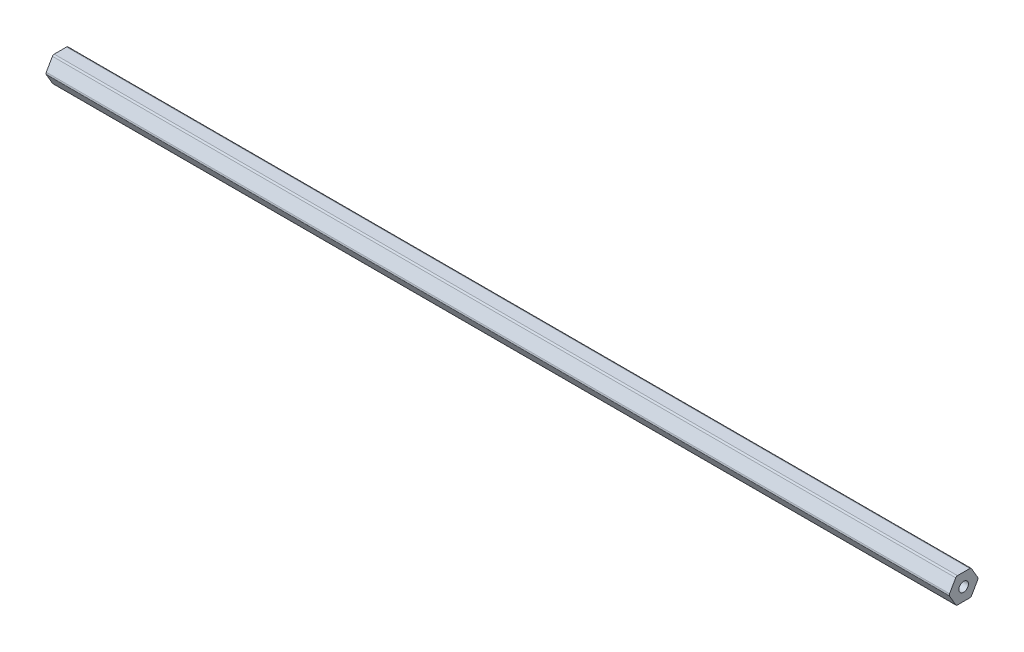
ISO-10303-21;
HEADER;
FILE_DESCRIPTION(('STEP AP214'),'2;1');
FILE_NAME('part.step','',(''),(''),'','','');
FILE_SCHEMA(('AUTOMOTIVE_DESIGN { 1 0 10303 214 1 1 1 1 }'));
ENDSEC;
DATA;
#1=APPLICATION_CONTEXT('core data for automotive mechanical design processes');
#2=APPLICATION_PROTOCOL_DEFINITION('international standard','automotive_design',2000,#1);
#3=PRODUCT_CONTEXT('',#1,'mechanical');
#4=PRODUCT('Part','Part','',(#3));
#5=PRODUCT_RELATED_PRODUCT_CATEGORY('part','',(#4));
#6=PRODUCT_DEFINITION_FORMATION('','',#4);
#7=PRODUCT_DEFINITION_CONTEXT('part definition',#1,'design');
#8=PRODUCT_DEFINITION('design','',#6,#7);
#9=PRODUCT_DEFINITION_SHAPE('','',#8);
#10=(LENGTH_UNIT() NAMED_UNIT(*) SI_UNIT(.MILLI.,.METRE.));
#11=(NAMED_UNIT(*) PLANE_ANGLE_UNIT() SI_UNIT($,.RADIAN.));
#12=(NAMED_UNIT(*) SI_UNIT($,.STERADIAN.) SOLID_ANGLE_UNIT());
#13=UNCERTAINTY_MEASURE_WITH_UNIT(LENGTH_MEASURE(1.E-05),#10,'distance_accuracy_value','');
#14=(GEOMETRIC_REPRESENTATION_CONTEXT(3) GLOBAL_UNCERTAINTY_ASSIGNED_CONTEXT((#13)) GLOBAL_UNIT_ASSIGNED_CONTEXT((#10,
#11,#12)) REPRESENTATION_CONTEXT('',''));
#15=CARTESIAN_POINT('',(0.,0.,0.));
#16=DIRECTION('',(0.,0.,1.));
#17=DIRECTION('',(1.,0.,0.));
#18=AXIS2_PLACEMENT_3D('',#15,#16,#17);
#19=CARTESIAN_POINT('',(-225.425,5.334,-3.07958633585748));
#20=DIRECTION('',(1.,0.,0.));
#21=DIRECTION('',(0.,0.,-1.));
#22=AXIS2_PLACEMENT_3D('',#19,#20,#21);
#23=CYLINDRICAL_SURFACE('',#22,1.016);
#24=DIRECTION('',(1.,0.,0.));
#25=VECTOR('',#24,1.);
#26=CARTESIAN_POINT('',(-225.425,6.34999999999999,-3.07958633585748));
#27=LINE('',#26,#25);
#28=CARTESIAN_POINT('',(-225.425,6.34999999999999,-3.07958633585748));
#29=VERTEX_POINT('',#28);
#30=CARTESIAN_POINT('',(225.425,6.34999999999999,-3.07958633585748));
#31=VERTEX_POINT('',#30);
#32=EDGE_CURVE('E43',#29,#31,#27,.T.);
#33=ORIENTED_EDGE('',*,*,#32,.T.);
#34=CARTESIAN_POINT('',(225.425,5.334,-3.07958633585748));
#35=DIRECTION('',(1.,0.,0.));
#36=DIRECTION('',(0.,0.,1.));
#37=AXIS2_PLACEMENT_3D('',#34,#35,#36);
#38=CIRCLE('',#37,1.016);
#39=CARTESIAN_POINT('',(225.425,5.84199999999999,-3.95946814610247));
#40=VERTEX_POINT('',#39);
#41=EDGE_CURVE('E128',#40,#31,#38,.T.);
#42=ORIENTED_EDGE('',*,*,#41,.F.);
#43=DIRECTION('',(1.,0.,0.));
#44=VECTOR('',#43,1.);
#45=CARTESIAN_POINT('',(-225.425,5.84199999999999,-3.95946814610247));
#46=LINE('',#45,#44);
#47=CARTESIAN_POINT('',(-225.425,5.84199999999999,-3.95946814610247));
#48=VERTEX_POINT('',#47);
#49=EDGE_CURVE('E11',#48,#40,#46,.T.);
#50=ORIENTED_EDGE('',*,*,#49,.F.);
#51=CARTESIAN_POINT('',(-225.425,5.334,-3.07958633585748));
#52=DIRECTION('',(1.,0.,0.));
#53=DIRECTION('',(0.,0.,1.));
#54=AXIS2_PLACEMENT_3D('',#51,#52,#53);
#55=CIRCLE('',#54,1.016);
#56=EDGE_CURVE('E129',#48,#29,#55,.T.);
#57=ORIENTED_EDGE('',*,*,#56,.T.);
#58=EDGE_LOOP('',(#33,#42,#50,#57));
#59=FACE_BOUND('',#58,.T.);
#60=ADVANCED_FACE('F40',(#59),#23,.T.);
#61=CARTESIAN_POINT('',(-225.425,0.50799999999998,-7.03905448195992));
#62=DIRECTION('',(0.,0.499999999999997,-0.86602540378444));
#63=DIRECTION('',(0.,0.86602540378444,0.499999999999997));
#64=AXIS2_PLACEMENT_3D('',#61,#62,#63);
#65=PLANE('',#64);
#66=ORIENTED_EDGE('',*,*,#49,.T.);
#67=DIRECTION('',(0.,0.86602540378444,0.499999999999997));
#68=VECTOR('',#67,1.);
#69=CARTESIAN_POINT('',(225.425,0.50799999999998,-7.03905448195992));
#70=LINE('',#69,#68);
#71=CARTESIAN_POINT('',(225.425,0.507999999999981,-7.03905448195992));
#72=VERTEX_POINT('',#71);
#73=EDGE_CURVE('E147',#72,#40,#70,.T.);
#74=ORIENTED_EDGE('',*,*,#73,.F.);
#75=DIRECTION('',(1.,0.,0.));
#76=VECTOR('',#75,1.);
#77=CARTESIAN_POINT('',(-225.425,0.507999999999981,-7.03905448195992));
#78=LINE('',#77,#76);
#79=CARTESIAN_POINT('',(-225.425,0.507999999999981,-7.03905448195992));
#80=VERTEX_POINT('',#79);
#81=EDGE_CURVE('E48',#80,#72,#78,.T.);
#82=ORIENTED_EDGE('',*,*,#81,.F.);
#83=DIRECTION('',(0.,0.86602540378444,0.499999999999997));
#84=VECTOR('',#83,1.);
#85=CARTESIAN_POINT('',(-225.425,0.50799999999998,-7.03905448195992));
#86=LINE('',#85,#84);
#87=EDGE_CURVE('E134',#80,#48,#86,.T.);
#88=ORIENTED_EDGE('',*,*,#87,.T.);
#89=EDGE_LOOP('',(#66,#74,#82,#88));
#90=FACE_BOUND('',#89,.T.);
#91=ADVANCED_FACE('F265',(#90),#65,.T.);
#92=CARTESIAN_POINT('',(-225.425,0.,-6.15917267171493));
#93=DIRECTION('',(1.,0.,0.));
#94=DIRECTION('',(0.,0.,-1.));
#95=AXIS2_PLACEMENT_3D('',#92,#93,#94);
#96=CYLINDRICAL_SURFACE('',#95,1.016);
#97=ORIENTED_EDGE('',*,*,#81,.T.);
#98=CARTESIAN_POINT('',(225.425,0.,-6.15917267171493));
#99=DIRECTION('',(1.,0.,0.));
#100=DIRECTION('',(0.,0.,1.));
#101=AXIS2_PLACEMENT_3D('',#98,#99,#100);
#102=CIRCLE('',#101,1.016);
#103=CARTESIAN_POINT('',(225.425,-0.508000000000019,-7.03905448195992));
#104=VERTEX_POINT('',#103);
#105=EDGE_CURVE('E175',#104,#72,#102,.T.);
#106=ORIENTED_EDGE('',*,*,#105,.F.);
#107=DIRECTION('',(1.,0.,0.));
#108=VECTOR('',#107,1.);
#109=CARTESIAN_POINT('',(-225.425,-0.508000000000019,-7.03905448195992));
#110=LINE('',#109,#108);
#111=CARTESIAN_POINT('',(-225.425,-0.508000000000019,-7.03905448195992));
#112=VERTEX_POINT('',#111);
#113=EDGE_CURVE('E212',#112,#104,#110,.T.);
#114=ORIENTED_EDGE('',*,*,#113,.F.);
#115=CARTESIAN_POINT('',(-225.425,0.,-6.15917267171493));
#116=DIRECTION('',(1.,0.,0.));
#117=DIRECTION('',(0.,0.,1.));
#118=AXIS2_PLACEMENT_3D('',#115,#116,#117);
#119=CIRCLE('',#118,1.016);
#120=EDGE_CURVE('E208',#112,#80,#119,.T.);
#121=ORIENTED_EDGE('',*,*,#120,.T.);
#122=EDGE_LOOP('',(#97,#106,#114,#121));
#123=FACE_BOUND('',#122,.T.);
#124=ADVANCED_FACE('F263',(#123),#96,.T.);
#125=CARTESIAN_POINT('',(-225.425,-5.84200000000001,-3.95946814610244));
#126=DIRECTION('',(0.,-0.500000000000002,-0.866025403784437));
#127=DIRECTION('',(0.,0.866025403784437,-0.500000000000003));
#128=AXIS2_PLACEMENT_3D('',#125,#126,#127);
#129=PLANE('',#128);
#130=ORIENTED_EDGE('',*,*,#113,.T.);
#131=DIRECTION('',(0.,0.866025403784437,-0.500000000000002));
#132=VECTOR('',#131,1.);
#133=CARTESIAN_POINT('',(225.425,-5.84200000000001,-3.95946814610244));
#134=LINE('',#133,#132);
#135=CARTESIAN_POINT('',(225.425,-5.84200000000001,-3.95946814610244));
#136=VERTEX_POINT('',#135);
#137=EDGE_CURVE('E172',#136,#104,#134,.T.);
#138=ORIENTED_EDGE('',*,*,#137,.F.);
#139=DIRECTION('',(1.,0.,0.));
#140=VECTOR('',#139,1.);
#141=CARTESIAN_POINT('',(-225.425,-5.84200000000001,-3.95946814610244));
#142=LINE('',#141,#140);
#143=CARTESIAN_POINT('',(-225.425,-5.84200000000001,-3.95946814610244));
#144=VERTEX_POINT('',#143);
#145=EDGE_CURVE('E214',#144,#136,#142,.T.);
#146=ORIENTED_EDGE('',*,*,#145,.F.);
#147=DIRECTION('',(0.,0.866025403784437,-0.500000000000002));
#148=VECTOR('',#147,1.);
#149=CARTESIAN_POINT('',(-225.425,-5.84200000000001,-3.95946814610244));
#150=LINE('',#149,#148);
#151=EDGE_CURVE('E205',#144,#112,#150,.T.);
#152=ORIENTED_EDGE('',*,*,#151,.T.);
#153=EDGE_LOOP('',(#130,#138,#146,#152));
#154=FACE_BOUND('',#153,.T.);
#155=ADVANCED_FACE('F261',(#154),#129,.T.);
#156=CARTESIAN_POINT('',(-225.425,-5.33400000000001,-3.07958633585745));
#157=DIRECTION('',(1.,0.,0.));
#158=DIRECTION('',(0.,0.,-1.));
#159=AXIS2_PLACEMENT_3D('',#156,#157,#158);
#160=CYLINDRICAL_SURFACE('',#159,1.016);
#161=ORIENTED_EDGE('',*,*,#145,.T.);
#162=CARTESIAN_POINT('',(225.425,-5.33400000000001,-3.07958633585745));
#163=DIRECTION('',(1.,0.,0.));
#164=DIRECTION('',(0.,0.,1.));
#165=AXIS2_PLACEMENT_3D('',#162,#163,#164);
#166=CIRCLE('',#165,1.016);
#167=CARTESIAN_POINT('',(225.425,-6.35000000000001,-3.07958633585745));
#168=VERTEX_POINT('',#167);
#169=EDGE_CURVE('E169',#168,#136,#166,.T.);
#170=ORIENTED_EDGE('',*,*,#169,.F.);
#171=DIRECTION('',(1.,0.,0.));
#172=VECTOR('',#171,1.);
#173=CARTESIAN_POINT('',(-225.425,-6.35000000000001,-3.07958633585745));
#174=LINE('',#173,#172);
#175=CARTESIAN_POINT('',(-225.425,-6.35000000000001,-3.07958633585745));
#176=VERTEX_POINT('',#175);
#177=EDGE_CURVE('E216',#176,#168,#174,.T.);
#178=ORIENTED_EDGE('',*,*,#177,.F.);
#179=CARTESIAN_POINT('',(-225.425,-5.33400000000001,-3.07958633585745));
#180=DIRECTION('',(1.,0.,0.));
#181=DIRECTION('',(0.,0.,1.));
#182=AXIS2_PLACEMENT_3D('',#179,#180,#181);
#183=CIRCLE('',#182,1.016);
#184=EDGE_CURVE('E202',#176,#144,#183,.T.);
#185=ORIENTED_EDGE('',*,*,#184,.T.);
#186=EDGE_LOOP('',(#161,#170,#178,#185));
#187=FACE_BOUND('',#186,.T.);
#188=ADVANCED_FACE('F256',(#187),#160,.T.);
#189=CARTESIAN_POINT('',(-225.425,-6.35,3.07958633585748));
#190=DIRECTION('',(0.,-1.,0.));
#191=DIRECTION('',(0.,0.,-1.));
#192=AXIS2_PLACEMENT_3D('',#189,#190,#191);
#193=PLANE('',#192);
#194=ORIENTED_EDGE('',*,*,#177,.T.);
#195=DIRECTION('',(0.,0.,-1.));
#196=VECTOR('',#195,1.);
#197=CARTESIAN_POINT('',(225.425,-6.35,3.07958633585748));
#198=LINE('',#197,#196);
#199=CARTESIAN_POINT('',(225.425,-6.35,3.07958633585748));
#200=VERTEX_POINT('',#199);
#201=EDGE_CURVE('E166',#200,#168,#198,.T.);
#202=ORIENTED_EDGE('',*,*,#201,.F.);
#203=DIRECTION('',(1.,0.,0.));
#204=VECTOR('',#203,1.);
#205=CARTESIAN_POINT('',(-225.425,-6.35,3.07958633585748));
#206=LINE('',#205,#204);
#207=CARTESIAN_POINT('',(-225.425,-6.35,3.07958633585748));
#208=VERTEX_POINT('',#207);
#209=EDGE_CURVE('E218',#208,#200,#206,.T.);
#210=ORIENTED_EDGE('',*,*,#209,.F.);
#211=DIRECTION('',(0.,0.,-1.));
#212=VECTOR('',#211,1.);
#213=CARTESIAN_POINT('',(-225.425,-6.35,3.07958633585748));
#214=LINE('',#213,#212);
#215=EDGE_CURVE('E199',#208,#176,#214,.T.);
#216=ORIENTED_EDGE('',*,*,#215,.T.);
#217=EDGE_LOOP('',(#194,#202,#210,#216));
#218=FACE_BOUND('',#217,.T.);
#219=ADVANCED_FACE('F251',(#218),#193,.T.);
#220=CARTESIAN_POINT('',(-225.425,-5.334,3.07958633585748));
#221=DIRECTION('',(1.,0.,0.));
#222=DIRECTION('',(0.,0.,-1.));
#223=AXIS2_PLACEMENT_3D('',#220,#221,#222);
#224=CYLINDRICAL_SURFACE('',#223,1.016);
#225=ORIENTED_EDGE('',*,*,#209,.T.);
#226=CARTESIAN_POINT('',(225.425,-5.334,3.07958633585748));
#227=DIRECTION('',(1.,0.,0.));
#228=DIRECTION('',(0.,0.,1.));
#229=AXIS2_PLACEMENT_3D('',#226,#227,#228);
#230=CIRCLE('',#229,1.016);
#231=CARTESIAN_POINT('',(225.425,-5.84199999999999,3.95946814610247));
#232=VERTEX_POINT('',#231);
#233=EDGE_CURVE('E163',#232,#200,#230,.T.);
#234=ORIENTED_EDGE('',*,*,#233,.F.);
#235=DIRECTION('',(1.,0.,0.));
#236=VECTOR('',#235,1.);
#237=CARTESIAN_POINT('',(-225.425,-5.84199999999999,3.95946814610247));
#238=LINE('',#237,#236);
#239=CARTESIAN_POINT('',(-225.425,-5.84199999999999,3.95946814610247));
#240=VERTEX_POINT('',#239);
#241=EDGE_CURVE('E220',#240,#232,#238,.T.);
#242=ORIENTED_EDGE('',*,*,#241,.F.);
#243=CARTESIAN_POINT('',(-225.425,-5.334,3.07958633585748));
#244=DIRECTION('',(1.,0.,0.));
#245=DIRECTION('',(0.,0.,1.));
#246=AXIS2_PLACEMENT_3D('',#243,#244,#245);
#247=CIRCLE('',#246,1.016);
#248=EDGE_CURVE('E196',#240,#208,#247,.T.);
#249=ORIENTED_EDGE('',*,*,#248,.T.);
#250=EDGE_LOOP('',(#225,#234,#242,#249));
#251=FACE_BOUND('',#250,.T.);
#252=ADVANCED_FACE('F249',(#251),#224,.T.);
#253=CARTESIAN_POINT('',(-225.425,-0.507999999999979,7.03905448195992));
#254=DIRECTION('',(0.,-0.499999999999998,0.86602540378444));
#255=DIRECTION('',(0.,-0.86602540378444,-0.499999999999998));
#256=AXIS2_PLACEMENT_3D('',#253,#254,#255);
#257=PLANE('',#256);
#258=ORIENTED_EDGE('',*,*,#241,.T.);
#259=DIRECTION('',(0.,-0.86602540378444,-0.499999999999998));
#260=VECTOR('',#259,1.);
#261=CARTESIAN_POINT('',(225.425,-0.507999999999979,7.03905448195992));
#262=LINE('',#261,#260);
#263=CARTESIAN_POINT('',(225.425,-0.50799999999998,7.03905448195993));
#264=VERTEX_POINT('',#263);
#265=EDGE_CURVE('E160',#264,#232,#262,.T.);
#266=ORIENTED_EDGE('',*,*,#265,.F.);
#267=DIRECTION('',(1.,0.,0.));
#268=VECTOR('',#267,1.);
#269=CARTESIAN_POINT('',(-225.425,-0.50799999999998,7.03905448195993));
#270=LINE('',#269,#268);
#271=CARTESIAN_POINT('',(-225.425,-0.50799999999998,7.03905448195993));
#272=VERTEX_POINT('',#271);
#273=EDGE_CURVE('E222',#272,#264,#270,.T.);
#274=ORIENTED_EDGE('',*,*,#273,.F.);
#275=DIRECTION('',(0.,-0.86602540378444,-0.499999999999998));
#276=VECTOR('',#275,1.);
#277=CARTESIAN_POINT('',(-225.425,-0.507999999999979,7.03905448195992));
#278=LINE('',#277,#276);
#279=EDGE_CURVE('E193',#272,#240,#278,.T.);
#280=ORIENTED_EDGE('',*,*,#279,.T.);
#281=EDGE_LOOP('',(#258,#266,#274,#280));
#282=FACE_BOUND('',#281,.T.);
#283=ADVANCED_FACE('F244',(#282),#257,.T.);
#284=CARTESIAN_POINT('',(-225.425,0.,6.15917267171493));
#285=DIRECTION('',(1.,0.,0.));
#286=DIRECTION('',(0.,0.,-1.));
#287=AXIS2_PLACEMENT_3D('',#284,#285,#286);
#288=CYLINDRICAL_SURFACE('',#287,1.016);
#289=ORIENTED_EDGE('',*,*,#273,.T.);
#290=CARTESIAN_POINT('',(225.425,0.,6.15917267171493));
#291=DIRECTION('',(1.,0.,0.));
#292=DIRECTION('',(0.,0.,1.));
#293=AXIS2_PLACEMENT_3D('',#290,#291,#292);
#294=CIRCLE('',#293,1.016);
#295=CARTESIAN_POINT('',(225.425,0.508000000000022,7.03905448195992));
#296=VERTEX_POINT('',#295);
#297=EDGE_CURVE('E157',#296,#264,#294,.T.);
#298=ORIENTED_EDGE('',*,*,#297,.F.);
#299=DIRECTION('',(1.,0.,0.));
#300=VECTOR('',#299,1.);
#301=CARTESIAN_POINT('',(-225.425,0.508000000000022,7.03905448195992));
#302=LINE('',#301,#300);
#303=CARTESIAN_POINT('',(-225.425,0.508000000000022,7.03905448195992));
#304=VERTEX_POINT('',#303);
#305=EDGE_CURVE('E224',#304,#296,#302,.T.);
#306=ORIENTED_EDGE('',*,*,#305,.F.);
#307=CARTESIAN_POINT('',(-225.425,0.,6.15917267171493));
#308=DIRECTION('',(1.,0.,0.));
#309=DIRECTION('',(0.,0.,1.));
#310=AXIS2_PLACEMENT_3D('',#307,#308,#309);
#311=CIRCLE('',#310,1.016);
#312=EDGE_CURVE('E190',#304,#272,#311,.T.);
#313=ORIENTED_EDGE('',*,*,#312,.T.);
#314=EDGE_LOOP('',(#289,#298,#306,#313));
#315=FACE_BOUND('',#314,.T.);
#316=ADVANCED_FACE('F237',(#315),#288,.T.);
#317=CARTESIAN_POINT('',(-225.425,5.84200000000001,3.95946814610244));
#318=DIRECTION('',(0.,0.500000000000003,0.866025403784437));
#319=DIRECTION('',(0.,-0.866025403784437,0.500000000000003));
#320=AXIS2_PLACEMENT_3D('',#317,#318,#319);
#321=PLANE('',#320);
#322=ORIENTED_EDGE('',*,*,#305,.T.);
#323=DIRECTION('',(0.,-0.866025403784437,0.500000000000003));
#324=VECTOR('',#323,1.);
#325=CARTESIAN_POINT('',(225.425,5.84200000000001,3.95946814610244));
#326=LINE('',#325,#324);
#327=CARTESIAN_POINT('',(225.425,5.84200000000001,3.95946814610244));
#328=VERTEX_POINT('',#327);
#329=EDGE_CURVE('E154',#328,#296,#326,.T.);
#330=ORIENTED_EDGE('',*,*,#329,.F.);
#331=DIRECTION('',(1.,0.,0.));
#332=VECTOR('',#331,1.);
#333=CARTESIAN_POINT('',(-225.425,5.84200000000001,3.95946814610244));
#334=LINE('',#333,#332);
#335=CARTESIAN_POINT('',(-225.425,5.84200000000001,3.95946814610244));
#336=VERTEX_POINT('',#335);
#337=EDGE_CURVE('E226',#336,#328,#334,.T.);
#338=ORIENTED_EDGE('',*,*,#337,.F.);
#339=DIRECTION('',(0.,-0.866025403784437,0.500000000000003));
#340=VECTOR('',#339,1.);
#341=CARTESIAN_POINT('',(-225.425,5.84200000000001,3.95946814610244));
#342=LINE('',#341,#340);
#343=EDGE_CURVE('E187',#336,#304,#342,.T.);
#344=ORIENTED_EDGE('',*,*,#343,.T.);
#345=EDGE_LOOP('',(#322,#330,#338,#344));
#346=FACE_BOUND('',#345,.T.);
#347=ADVANCED_FACE('F234',(#346),#321,.T.);
#348=CARTESIAN_POINT('',(-225.425,5.33400000000001,3.07958633585745));
#349=DIRECTION('',(1.,0.,0.));
#350=DIRECTION('',(0.,0.,-1.));
#351=AXIS2_PLACEMENT_3D('',#348,#349,#350);
#352=CYLINDRICAL_SURFACE('',#351,1.016);
#353=ORIENTED_EDGE('',*,*,#337,.T.);
#354=CARTESIAN_POINT('',(225.425,5.33400000000001,3.07958633585745));
#355=DIRECTION('',(1.,0.,0.));
#356=DIRECTION('',(0.,0.,1.));
#357=AXIS2_PLACEMENT_3D('',#354,#355,#356);
#358=CIRCLE('',#357,1.016);
#359=CARTESIAN_POINT('',(225.425,6.35000000000001,3.07958633585745));
#360=VERTEX_POINT('',#359);
#361=EDGE_CURVE('E141',#360,#328,#358,.T.);
#362=ORIENTED_EDGE('',*,*,#361,.F.);
#363=DIRECTION('',(1.,0.,0.));
#364=VECTOR('',#363,1.);
#365=CARTESIAN_POINT('',(-225.425,6.35000000000001,3.07958633585745));
#366=LINE('',#365,#364);
#367=CARTESIAN_POINT('',(-225.425,6.35000000000001,3.07958633585745));
#368=VERTEX_POINT('',#367);
#369=EDGE_CURVE('E133',#368,#360,#366,.T.);
#370=ORIENTED_EDGE('',*,*,#369,.F.);
#371=CARTESIAN_POINT('',(-225.425,5.33400000000001,3.07958633585745));
#372=DIRECTION('',(1.,0.,0.));
#373=DIRECTION('',(0.,0.,1.));
#374=AXIS2_PLACEMENT_3D('',#371,#372,#373);
#375=CIRCLE('',#374,1.016);
#376=EDGE_CURVE('E184',#368,#336,#375,.T.);
#377=ORIENTED_EDGE('',*,*,#376,.T.);
#378=EDGE_LOOP('',(#353,#362,#370,#377));
#379=FACE_BOUND('',#378,.T.);
#380=ADVANCED_FACE('F228',(#379),#352,.T.);
#381=CARTESIAN_POINT('',(-225.425,6.34999999999999,-3.07958633585748));
#382=DIRECTION('',(0.,1.,0.));
#383=DIRECTION('',(0.,0.,1.));
#384=AXIS2_PLACEMENT_3D('',#381,#382,#383);
#385=PLANE('',#384);
#386=ORIENTED_EDGE('',*,*,#369,.T.);
#387=DIRECTION('',(0.,0.,1.));
#388=VECTOR('',#387,1.);
#389=CARTESIAN_POINT('',(225.425,6.34999999999999,-3.07958633585748));
#390=LINE('',#389,#388);
#391=EDGE_CURVE('E136',#31,#360,#390,.T.);
#392=ORIENTED_EDGE('',*,*,#391,.F.);
#393=ORIENTED_EDGE('',*,*,#32,.F.);
#394=DIRECTION('',(0.,0.,1.));
#395=VECTOR('',#394,1.);
#396=CARTESIAN_POINT('',(-225.425,6.34999999999999,-3.07958633585748));
#397=LINE('',#396,#395);
#398=EDGE_CURVE('E182',#29,#368,#397,.T.);
#399=ORIENTED_EDGE('',*,*,#398,.T.);
#400=EDGE_LOOP('',(#386,#392,#393,#399));
#401=FACE_BOUND('',#400,.T.);
#402=ADVANCED_FACE('F137',(#401),#385,.T.);
#403=CARTESIAN_POINT('',(-225.425,5.334,-3.07958633585748));
#404=DIRECTION('',(-1.,0.,0.));
#405=DIRECTION('',(0.,0.,1.));
#406=AXIS2_PLACEMENT_3D('',#403,#404,#405);
#407=PLANE('',#406);
#408=CARTESIAN_POINT('',(-225.425,0.,0.));
#409=DIRECTION('',(1.,0.,0.));
#410=DIRECTION('',(0.,0.,-1.));
#411=AXIS2_PLACEMENT_3D('',#408,#409,#410);
#412=CIRCLE('',#411,2.38125);
#413=CARTESIAN_POINT('',(-225.425,0.,-2.38125));
#414=VERTEX_POINT('',#413);
#415=EDGE_CURVE('E178',#414,#414,#412,.T.);
#416=ORIENTED_EDGE('',*,*,#415,.T.);
#417=EDGE_LOOP('',(#416));
#418=FACE_BOUND('',#417,.T.);
#419=ORIENTED_EDGE('',*,*,#56,.F.);
#420=ORIENTED_EDGE('',*,*,#87,.F.);
#421=ORIENTED_EDGE('',*,*,#120,.F.);
#422=ORIENTED_EDGE('',*,*,#151,.F.);
#423=ORIENTED_EDGE('',*,*,#184,.F.);
#424=ORIENTED_EDGE('',*,*,#215,.F.);
#425=ORIENTED_EDGE('',*,*,#248,.F.);
#426=ORIENTED_EDGE('',*,*,#279,.F.);
#427=ORIENTED_EDGE('',*,*,#312,.F.);
#428=ORIENTED_EDGE('',*,*,#343,.F.);
#429=ORIENTED_EDGE('',*,*,#376,.F.);
#430=ORIENTED_EDGE('',*,*,#398,.F.);
#431=EDGE_LOOP('',(#419,#420,#421,#422,#423,#424,#425,#426,#427,#428,#429,#430));
#432=FACE_BOUND('',#431,.T.);
#433=ADVANCED_FACE('F240',(#418,#432),#407,.T.);
#434=CARTESIAN_POINT('',(-225.425,0.,0.));
#435=DIRECTION('',(1.,0.,0.));
#436=DIRECTION('',(0.,0.,-1.));
#437=AXIS2_PLACEMENT_3D('',#434,#435,#436);
#438=CYLINDRICAL_SURFACE('',#437,2.38125);
#439=ORIENTED_EDGE('',*,*,#415,.F.);
#440=EDGE_LOOP('',(#439));
#441=FACE_BOUND('',#440,.T.);
#442=CARTESIAN_POINT('',(225.425,0.,0.));
#443=DIRECTION('',(1.,0.,0.));
#444=DIRECTION('',(0.,0.,-1.));
#445=AXIS2_PLACEMENT_3D('',#442,#443,#444);
#446=CIRCLE('',#445,2.38125);
#447=CARTESIAN_POINT('',(225.425,0.,-2.38125));
#448=VERTEX_POINT('',#447);
#449=EDGE_CURVE('E148',#448,#448,#446,.T.);
#450=ORIENTED_EDGE('',*,*,#449,.T.);
#451=EDGE_LOOP('',(#450));
#452=FACE_BOUND('',#451,.T.);
#453=ADVANCED_FACE('F295',(#441,#452),#438,.F.);
#454=CARTESIAN_POINT('',(225.425,5.334,-3.07958633585748));
#455=DIRECTION('',(-1.,0.,0.));
#456=DIRECTION('',(0.,0.,1.));
#457=AXIS2_PLACEMENT_3D('',#454,#455,#456);
#458=PLANE('',#457);
#459=ORIENTED_EDGE('',*,*,#41,.T.);
#460=ORIENTED_EDGE('',*,*,#391,.T.);
#461=ORIENTED_EDGE('',*,*,#361,.T.);
#462=ORIENTED_EDGE('',*,*,#329,.T.);
#463=ORIENTED_EDGE('',*,*,#297,.T.);
#464=ORIENTED_EDGE('',*,*,#265,.T.);
#465=ORIENTED_EDGE('',*,*,#233,.T.);
#466=ORIENTED_EDGE('',*,*,#201,.T.);
#467=ORIENTED_EDGE('',*,*,#169,.T.);
#468=ORIENTED_EDGE('',*,*,#137,.T.);
#469=ORIENTED_EDGE('',*,*,#105,.T.);
#470=ORIENTED_EDGE('',*,*,#73,.T.);
#471=EDGE_LOOP('',(#459,#460,#461,#462,#463,#464,#465,#466,#467,#468,#469,#470));
#472=FACE_BOUND('',#471,.T.);
#473=ORIENTED_EDGE('',*,*,#449,.F.);
#474=EDGE_LOOP('',(#473));
#475=FACE_BOUND('',#474,.T.);
#476=ADVANCED_FACE('F144',(#472,#475),#458,.F.);
#477=CLOSED_SHELL('',(#60,#91,#124,#155,#188,#219,#252,#283,#316,#347,#380,#402,#433,#453,#476));
#478=MANIFOLD_SOLID_BREP('B2',#477);
#479=ADVANCED_BREP_SHAPE_REPRESENTATION('',(#18,#478),#14);
#480=SHAPE_DEFINITION_REPRESENTATION(#9,#479);
ENDSEC;
END-ISO-10303-21;
